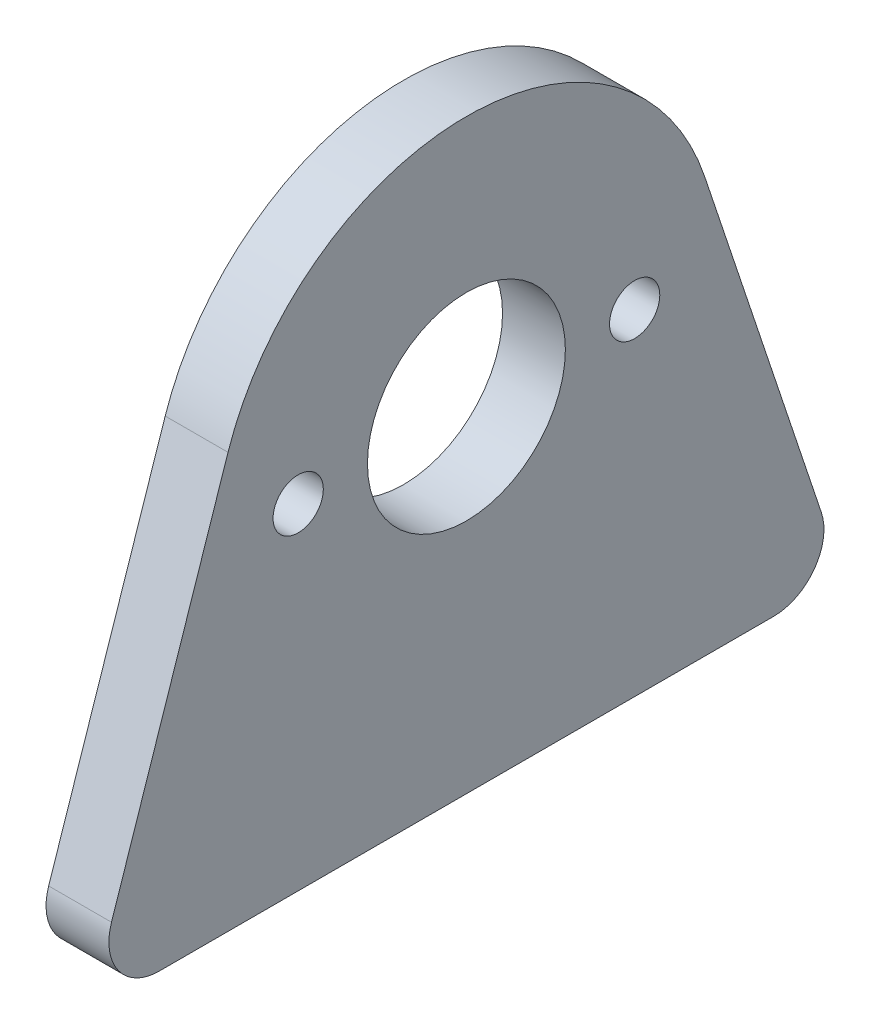
ISO-10303-21;
HEADER;
FILE_DESCRIPTION(('STEP AP214'),'2;1');
FILE_NAME('part.step','',(''),(''),'','','');
FILE_SCHEMA(('AUTOMOTIVE_DESIGN { 1 0 10303 214 1 1 1 1 }'));
ENDSEC;
DATA;
#1=APPLICATION_CONTEXT('core data for automotive mechanical design processes');
#2=APPLICATION_PROTOCOL_DEFINITION('international standard','automotive_design',2000,#1);
#3=PRODUCT_CONTEXT('',#1,'mechanical');
#4=PRODUCT('Part','Part','',(#3));
#5=PRODUCT_RELATED_PRODUCT_CATEGORY('part','',(#4));
#6=PRODUCT_DEFINITION_FORMATION('','',#4);
#7=PRODUCT_DEFINITION_CONTEXT('part definition',#1,'design');
#8=PRODUCT_DEFINITION('design','',#6,#7);
#9=PRODUCT_DEFINITION_SHAPE('','',#8);
#10=(LENGTH_UNIT() NAMED_UNIT(*) SI_UNIT(.MILLI.,.METRE.));
#11=(NAMED_UNIT(*) PLANE_ANGLE_UNIT() SI_UNIT($,.RADIAN.));
#12=(NAMED_UNIT(*) SI_UNIT($,.STERADIAN.) SOLID_ANGLE_UNIT());
#13=UNCERTAINTY_MEASURE_WITH_UNIT(LENGTH_MEASURE(1.E-05),#10,'distance_accuracy_value','');
#14=(GEOMETRIC_REPRESENTATION_CONTEXT(3) GLOBAL_UNCERTAINTY_ASSIGNED_CONTEXT((#13)) GLOBAL_UNIT_ASSIGNED_CONTEXT((#10,
#11,#12)) REPRESENTATION_CONTEXT('',''));
#15=CARTESIAN_POINT('',(0.,0.,0.));
#16=DIRECTION('',(0.,0.,1.));
#17=DIRECTION('',(1.,0.,0.));
#18=AXIS2_PLACEMENT_3D('',#15,#16,#17);
#19=CARTESIAN_POINT('',(-3.175,-14.398,15.5232218382456));
#20=DIRECTION('',(1.,0.,0.));
#21=DIRECTION('',(0.,0.,-1.));
#22=AXIS2_PLACEMENT_3D('',#19,#20,#21);
#23=CYLINDRICAL_SURFACE('',#22,2.54);
#24=DIRECTION('',(1.,0.,0.));
#25=VECTOR('',#24,1.);
#26=CARTESIAN_POINT('',(-3.175,-13.5930204930634,17.932289706408));
#27=LINE('',#26,#25);
#28=CARTESIAN_POINT('',(-3.175,-13.5930204930634,17.932289706408));
#29=VERTEX_POINT('',#28);
#30=CARTESIAN_POINT('',(0.,-13.5930204930634,17.932289706408));
#31=VERTEX_POINT('',#30);
#32=EDGE_CURVE('E153',#29,#31,#27,.T.);
#33=ORIENTED_EDGE('',*,*,#32,.F.);
#34=CARTESIAN_POINT('',(-3.175,-14.398,15.5232218382456));
#35=DIRECTION('',(1.,0.,0.));
#36=DIRECTION('',(0.,0.,-1.));
#37=AXIS2_PLACEMENT_3D('',#34,#35,#36);
#38=CIRCLE('',#37,2.54);
#39=CARTESIAN_POINT('',(-3.175,-16.938,15.5232218382456));
#40=VERTEX_POINT('',#39);
#41=EDGE_CURVE('E43',#40,#29,#38,.F.);
#42=ORIENTED_EDGE('',*,*,#41,.F.);
#43=DIRECTION('',(1.,0.,0.));
#44=VECTOR('',#43,1.);
#45=CARTESIAN_POINT('',(-3.175,-16.938,15.5232218382456));
#46=LINE('',#45,#44);
#47=CARTESIAN_POINT('',(0.,-16.938,15.5232218382456));
#48=VERTEX_POINT('',#47);
#49=EDGE_CURVE('E156',#48,#40,#46,.F.);
#50=ORIENTED_EDGE('',*,*,#49,.F.);
#51=CARTESIAN_POINT('',(0.,-14.398,15.5232218382456));
#52=DIRECTION('',(1.,0.,0.));
#53=DIRECTION('',(0.,0.,-1.));
#54=AXIS2_PLACEMENT_3D('',#51,#52,#53);
#55=CIRCLE('',#54,2.54);
#56=EDGE_CURVE('E11',#31,#48,#55,.T.);
#57=ORIENTED_EDGE('',*,*,#56,.F.);
#58=EDGE_LOOP('',(#33,#42,#50,#57));
#59=FACE_BOUND('',#58,.T.);
#60=ADVANCED_FACE('F36',(#59),#23,.T.);
#61=CARTESIAN_POINT('',(-3.175,-14.398,-15.5232218382456));
#62=DIRECTION('',(1.,0.,0.));
#63=DIRECTION('',(0.,0.,-1.));
#64=AXIS2_PLACEMENT_3D('',#61,#62,#63);
#65=CYLINDRICAL_SURFACE('',#64,2.54);
#66=DIRECTION('',(-1.,0.,0.));
#67=VECTOR('',#66,1.);
#68=CARTESIAN_POINT('',(-3.175,-13.5930204930634,-17.932289706408));
#69=LINE('',#68,#67);
#70=CARTESIAN_POINT('',(0.,-13.5930204930634,-17.932289706408));
#71=VERTEX_POINT('',#70);
#72=CARTESIAN_POINT('',(-3.175,-13.5930204930634,-17.932289706408));
#73=VERTEX_POINT('',#72);
#74=EDGE_CURVE('E94',#71,#73,#69,.T.);
#75=ORIENTED_EDGE('',*,*,#74,.F.);
#76=CARTESIAN_POINT('',(0.,-14.398,-15.5232218382456));
#77=DIRECTION('',(1.,0.,0.));
#78=DIRECTION('',(0.,0.,-1.));
#79=AXIS2_PLACEMENT_3D('',#76,#77,#78);
#80=CIRCLE('',#79,2.54);
#81=CARTESIAN_POINT('',(0.,-16.938,-15.5232218382457));
#82=VERTEX_POINT('',#81);
#83=EDGE_CURVE('E149',#82,#71,#80,.T.);
#84=ORIENTED_EDGE('',*,*,#83,.F.);
#85=DIRECTION('',(-1.,0.,0.));
#86=VECTOR('',#85,1.);
#87=CARTESIAN_POINT('',(-3.175,-16.938,-15.5232218382456));
#88=LINE('',#87,#86);
#89=CARTESIAN_POINT('',(-3.175,-16.938,-15.5232218382457));
#90=VERTEX_POINT('',#89);
#91=EDGE_CURVE('E146',#90,#82,#88,.F.);
#92=ORIENTED_EDGE('',*,*,#91,.F.);
#93=CARTESIAN_POINT('',(-3.175,-14.398,-15.5232218382456));
#94=DIRECTION('',(1.,0.,0.));
#95=DIRECTION('',(0.,0.,-1.));
#96=AXIS2_PLACEMENT_3D('',#93,#94,#95);
#97=CIRCLE('',#96,2.54);
#98=EDGE_CURVE('E151',#73,#90,#97,.F.);
#99=ORIENTED_EDGE('',*,*,#98,.F.);
#100=EDGE_LOOP('',(#75,#84,#92,#99));
#101=FACE_BOUND('',#100,.T.);
#102=ADVANCED_FACE('F164',(#101),#65,.T.);
#103=CARTESIAN_POINT('',(-3.175,4.02489753468298,-12.0453393408116));
#104=DIRECTION('',(0.,0.31692106572307,-0.948451916599336));
#105=DIRECTION('',(0.,0.948451916599336,0.31692106572307));
#106=AXIS2_PLACEMENT_3D('',#103,#104,#105);
#107=PLANE('',#106);
#108=DIRECTION('',(0.,0.948451916599336,0.31692106572307));
#109=VECTOR('',#108,1.);
#110=CARTESIAN_POINT('',(0.,4.02489753468298,-12.0453393408116));
#111=LINE('',#110,#109);
#112=CARTESIAN_POINT('',(0.,4.02489753468298,-12.0453393408116));
#113=VERTEX_POINT('',#112);
#114=EDGE_CURVE('E128',#71,#113,#111,.T.);
#115=ORIENTED_EDGE('',*,*,#114,.F.);
#116=ORIENTED_EDGE('',*,*,#74,.T.);
#117=DIRECTION('',(0.,0.948451916599336,0.31692106572307));
#118=VECTOR('',#117,1.);
#119=CARTESIAN_POINT('',(-3.175,4.02489753468298,-12.0453393408116));
#120=LINE('',#119,#118);
#121=CARTESIAN_POINT('',(-3.175,4.02489753468298,-12.0453393408116));
#122=VERTEX_POINT('',#121);
#123=EDGE_CURVE('E87',#73,#122,#120,.T.);
#124=ORIENTED_EDGE('',*,*,#123,.T.);
#125=DIRECTION('',(1.,0.,0.));
#126=VECTOR('',#125,1.);
#127=CARTESIAN_POINT('',(-3.175,4.02489753468298,-12.0453393408116));
#128=LINE('',#127,#126);
#129=EDGE_CURVE('E91',#122,#113,#128,.T.);
#130=ORIENTED_EDGE('',*,*,#129,.T.);
#131=EDGE_LOOP('',(#115,#116,#124,#130));
#132=FACE_BOUND('',#131,.T.);
#133=ADVANCED_FACE('F90',(#132),#107,.T.);
#134=CARTESIAN_POINT('',(-3.175,-16.938,0.));
#135=DIRECTION('',(0.,1.,0.));
#136=DIRECTION('',(0.,0.,1.));
#137=AXIS2_PLACEMENT_3D('',#134,#135,#136);
#138=PLANE('',#137);
#139=DIRECTION('',(0.,0.,1.));
#140=VECTOR('',#139,1.);
#141=CARTESIAN_POINT('',(0.,-16.938,0.));
#142=LINE('',#141,#140);
#143=EDGE_CURVE('E133',#82,#48,#142,.T.);
#144=ORIENTED_EDGE('',*,*,#143,.T.);
#145=ORIENTED_EDGE('',*,*,#49,.T.);
#146=DIRECTION('',(0.,0.,1.));
#147=VECTOR('',#146,1.);
#148=CARTESIAN_POINT('',(-3.175,-16.938,0.));
#149=LINE('',#148,#147);
#150=EDGE_CURVE('E116',#90,#40,#149,.T.);
#151=ORIENTED_EDGE('',*,*,#150,.F.);
#152=ORIENTED_EDGE('',*,*,#91,.T.);
#153=EDGE_LOOP('',(#144,#145,#151,#152));
#154=FACE_BOUND('',#153,.T.);
#155=ADVANCED_FACE('F166',(#154),#138,.F.);
#156=CARTESIAN_POINT('',(-3.175,4.02489753468298,12.0453393408116));
#157=DIRECTION('',(0.,-0.316921065723069,-0.948451916599336));
#158=DIRECTION('',(0.,0.948451916599336,-0.316921065723069));
#159=AXIS2_PLACEMENT_3D('',#156,#157,#158);
#160=PLANE('',#159);
#161=DIRECTION('',(0.,0.948451916599336,-0.316921065723069));
#162=VECTOR('',#161,1.);
#163=CARTESIAN_POINT('',(-3.175,4.02489753468298,12.0453393408116));
#164=LINE('',#163,#162);
#165=CARTESIAN_POINT('',(-3.175,4.02489753468298,12.0453393408116));
#166=VERTEX_POINT('',#165);
#167=EDGE_CURVE('E113',#29,#166,#164,.T.);
#168=ORIENTED_EDGE('',*,*,#167,.F.);
#169=ORIENTED_EDGE('',*,*,#32,.T.);
#170=DIRECTION('',(0.,0.948451916599336,-0.316921065723069));
#171=VECTOR('',#170,1.);
#172=CARTESIAN_POINT('',(0.,4.02489753468298,12.0453393408116));
#173=LINE('',#172,#171);
#174=CARTESIAN_POINT('',(0.,4.02489753468298,12.0453393408116));
#175=VERTEX_POINT('',#174);
#176=EDGE_CURVE('E131',#31,#175,#173,.T.);
#177=ORIENTED_EDGE('',*,*,#176,.T.);
#178=DIRECTION('',(1.,0.,0.));
#179=VECTOR('',#178,1.);
#180=CARTESIAN_POINT('',(-3.175,4.02489753468298,12.0453393408116));
#181=LINE('',#180,#179);
#182=EDGE_CURVE('E106',#166,#175,#181,.T.);
#183=ORIENTED_EDGE('',*,*,#182,.F.);
#184=EDGE_LOOP('',(#168,#169,#177,#183));
#185=FACE_BOUND('',#184,.T.);
#186=ADVANCED_FACE('F159',(#185),#160,.F.);
#187=CARTESIAN_POINT('',(-3.175,0.,8.5));
#188=DIRECTION('',(1.,0.,0.));
#189=DIRECTION('',(0.,0.,-1.));
#190=AXIS2_PLACEMENT_3D('',#187,#188,#189);
#191=CYLINDRICAL_SURFACE('',#190,1.27);
#192=CARTESIAN_POINT('',(-3.175,0.,8.5));
#193=DIRECTION('',(1.,0.,0.));
#194=DIRECTION('',(0.,0.,-1.));
#195=AXIS2_PLACEMENT_3D('',#192,#193,#194);
#196=CIRCLE('',#195,1.27);
#197=CARTESIAN_POINT('',(-3.175,0.,7.23));
#198=VERTEX_POINT('',#197);
#199=EDGE_CURVE('E123',#198,#198,#196,.T.);
#200=ORIENTED_EDGE('',*,*,#199,.F.);
#201=EDGE_LOOP('',(#200));
#202=FACE_BOUND('',#201,.T.);
#203=CARTESIAN_POINT('',(0.,0.,8.5));
#204=DIRECTION('',(1.,0.,0.));
#205=DIRECTION('',(0.,0.,-1.));
#206=AXIS2_PLACEMENT_3D('',#203,#204,#205);
#207=CIRCLE('',#206,1.27);
#208=CARTESIAN_POINT('',(0.,0.,7.23));
#209=VERTEX_POINT('',#208);
#210=EDGE_CURVE('E139',#209,#209,#207,.T.);
#211=ORIENTED_EDGE('',*,*,#210,.T.);
#212=EDGE_LOOP('',(#211));
#213=FACE_BOUND('',#212,.T.);
#214=ADVANCED_FACE('F173',(#202,#213),#191,.F.);
#215=CARTESIAN_POINT('',(-3.175,0.,0.));
#216=DIRECTION('',(1.,0.,0.));
#217=DIRECTION('',(0.,0.,-1.));
#218=AXIS2_PLACEMENT_3D('',#215,#216,#217);
#219=CYLINDRICAL_SURFACE('',#218,5.);
#220=CARTESIAN_POINT('',(-3.175,0.,0.));
#221=DIRECTION('',(1.,0.,0.));
#222=DIRECTION('',(0.,0.,-1.));
#223=AXIS2_PLACEMENT_3D('',#220,#221,#222);
#224=CIRCLE('',#223,5.);
#225=CARTESIAN_POINT('',(-3.175,0.,-5.));
#226=VERTEX_POINT('',#225);
#227=EDGE_CURVE('E120',#226,#226,#224,.T.);
#228=ORIENTED_EDGE('',*,*,#227,.F.);
#229=EDGE_LOOP('',(#228));
#230=FACE_BOUND('',#229,.T.);
#231=CARTESIAN_POINT('',(0.,0.,0.));
#232=DIRECTION('',(1.,0.,0.));
#233=DIRECTION('',(0.,0.,-1.));
#234=AXIS2_PLACEMENT_3D('',#231,#232,#233);
#235=CIRCLE('',#234,5.);
#236=CARTESIAN_POINT('',(0.,0.,-5.));
#237=VERTEX_POINT('',#236);
#238=EDGE_CURVE('E136',#237,#237,#235,.T.);
#239=ORIENTED_EDGE('',*,*,#238,.T.);
#240=EDGE_LOOP('',(#239));
#241=FACE_BOUND('',#240,.T.);
#242=ADVANCED_FACE('F186',(#230,#241),#219,.F.);
#243=CARTESIAN_POINT('',(-3.175,0.,0.));
#244=DIRECTION('',(1.,0.,0.));
#245=DIRECTION('',(0.,0.,-1.));
#246=AXIS2_PLACEMENT_3D('',#243,#244,#245);
#247=CYLINDRICAL_SURFACE('',#246,12.7);
#248=CARTESIAN_POINT('',(0.,0.,0.));
#249=DIRECTION('',(1.,0.,0.));
#250=DIRECTION('',(0.,0.,-1.));
#251=AXIS2_PLACEMENT_3D('',#248,#249,#250);
#252=CIRCLE('',#251,12.7);
#253=EDGE_CURVE('E105',#113,#175,#252,.T.);
#254=ORIENTED_EDGE('',*,*,#253,.F.);
#255=ORIENTED_EDGE('',*,*,#129,.F.);
#256=CARTESIAN_POINT('',(-3.175,0.,0.));
#257=DIRECTION('',(1.,0.,0.));
#258=DIRECTION('',(0.,0.,-1.));
#259=AXIS2_PLACEMENT_3D('',#256,#257,#258);
#260=CIRCLE('',#259,12.7);
#261=EDGE_CURVE('E97',#122,#166,#260,.T.);
#262=ORIENTED_EDGE('',*,*,#261,.T.);
#263=ORIENTED_EDGE('',*,*,#182,.T.);
#264=EDGE_LOOP('',(#254,#255,#262,#263));
#265=FACE_BOUND('',#264,.T.);
#266=ADVANCED_FACE('F102',(#265),#247,.T.);
#267=CARTESIAN_POINT('',(-3.175,0.,-8.5));
#268=DIRECTION('',(1.,0.,0.));
#269=DIRECTION('',(0.,0.,-1.));
#270=AXIS2_PLACEMENT_3D('',#267,#268,#269);
#271=CYLINDRICAL_SURFACE('',#270,1.27);
#272=CARTESIAN_POINT('',(-3.175,0.,-8.5));
#273=DIRECTION('',(1.,0.,0.));
#274=DIRECTION('',(0.,0.,-1.));
#275=AXIS2_PLACEMENT_3D('',#272,#273,#274);
#276=CIRCLE('',#275,1.27);
#277=CARTESIAN_POINT('',(-3.175,0.,-9.77));
#278=VERTEX_POINT('',#277);
#279=EDGE_CURVE('E107',#278,#278,#276,.T.);
#280=ORIENTED_EDGE('',*,*,#279,.F.);
#281=EDGE_LOOP('',(#280));
#282=FACE_BOUND('',#281,.T.);
#283=CARTESIAN_POINT('',(0.,0.,-8.5));
#284=DIRECTION('',(1.,0.,0.));
#285=DIRECTION('',(0.,0.,-1.));
#286=AXIS2_PLACEMENT_3D('',#283,#284,#285);
#287=CIRCLE('',#286,1.27);
#288=CARTESIAN_POINT('',(0.,0.,-9.77));
#289=VERTEX_POINT('',#288);
#290=EDGE_CURVE('E98',#289,#289,#287,.T.);
#291=ORIENTED_EDGE('',*,*,#290,.T.);
#292=EDGE_LOOP('',(#291));
#293=FACE_BOUND('',#292,.T.);
#294=ADVANCED_FACE('F185',(#282,#293),#271,.F.);
#295=CARTESIAN_POINT('',(-3.175,0.,0.));
#296=DIRECTION('',(1.,0.,0.));
#297=DIRECTION('',(0.,0.,-1.));
#298=AXIS2_PLACEMENT_3D('',#295,#296,#297);
#299=PLANE('',#298);
#300=ORIENTED_EDGE('',*,*,#150,.T.);
#301=ORIENTED_EDGE('',*,*,#41,.T.);
#302=ORIENTED_EDGE('',*,*,#167,.T.);
#303=ORIENTED_EDGE('',*,*,#261,.F.);
#304=ORIENTED_EDGE('',*,*,#123,.F.);
#305=ORIENTED_EDGE('',*,*,#98,.T.);
#306=EDGE_LOOP('',(#300,#301,#302,#303,#304,#305));
#307=FACE_BOUND('',#306,.T.);
#308=ORIENTED_EDGE('',*,*,#227,.T.);
#309=EDGE_LOOP('',(#308));
#310=FACE_BOUND('',#309,.T.);
#311=ORIENTED_EDGE('',*,*,#199,.T.);
#312=EDGE_LOOP('',(#311));
#313=FACE_BOUND('',#312,.T.);
#314=ORIENTED_EDGE('',*,*,#279,.T.);
#315=EDGE_LOOP('',(#314));
#316=FACE_BOUND('',#315,.T.);
#317=ADVANCED_FACE('F110',(#307,#310,#313,#316),#299,.F.);
#318=CARTESIAN_POINT('',(0.,0.,0.));
#319=DIRECTION('',(1.,0.,0.));
#320=DIRECTION('',(0.,0.,-1.));
#321=AXIS2_PLACEMENT_3D('',#318,#319,#320);
#322=PLANE('',#321);
#323=ORIENTED_EDGE('',*,*,#176,.F.);
#324=ORIENTED_EDGE('',*,*,#56,.T.);
#325=ORIENTED_EDGE('',*,*,#143,.F.);
#326=ORIENTED_EDGE('',*,*,#83,.T.);
#327=ORIENTED_EDGE('',*,*,#114,.T.);
#328=ORIENTED_EDGE('',*,*,#253,.T.);
#329=EDGE_LOOP('',(#323,#324,#325,#326,#327,#328));
#330=FACE_BOUND('',#329,.T.);
#331=ORIENTED_EDGE('',*,*,#238,.F.);
#332=EDGE_LOOP('',(#331));
#333=FACE_BOUND('',#332,.T.);
#334=ORIENTED_EDGE('',*,*,#210,.F.);
#335=EDGE_LOOP('',(#334));
#336=FACE_BOUND('',#335,.T.);
#337=ORIENTED_EDGE('',*,*,#290,.F.);
#338=EDGE_LOOP('',(#337));
#339=FACE_BOUND('',#338,.T.);
#340=ADVANCED_FACE('F160',(#330,#333,#336,#339),#322,.T.);
#341=CLOSED_SHELL('',(#60,#102,#133,#155,#186,#214,#242,#266,#294,#317,#340));
#342=MANIFOLD_SOLID_BREP('B2',#341);
#343=ADVANCED_BREP_SHAPE_REPRESENTATION('',(#18,#342),#14);
#344=SHAPE_DEFINITION_REPRESENTATION(#9,#343);
ENDSEC;
END-ISO-10303-21;
